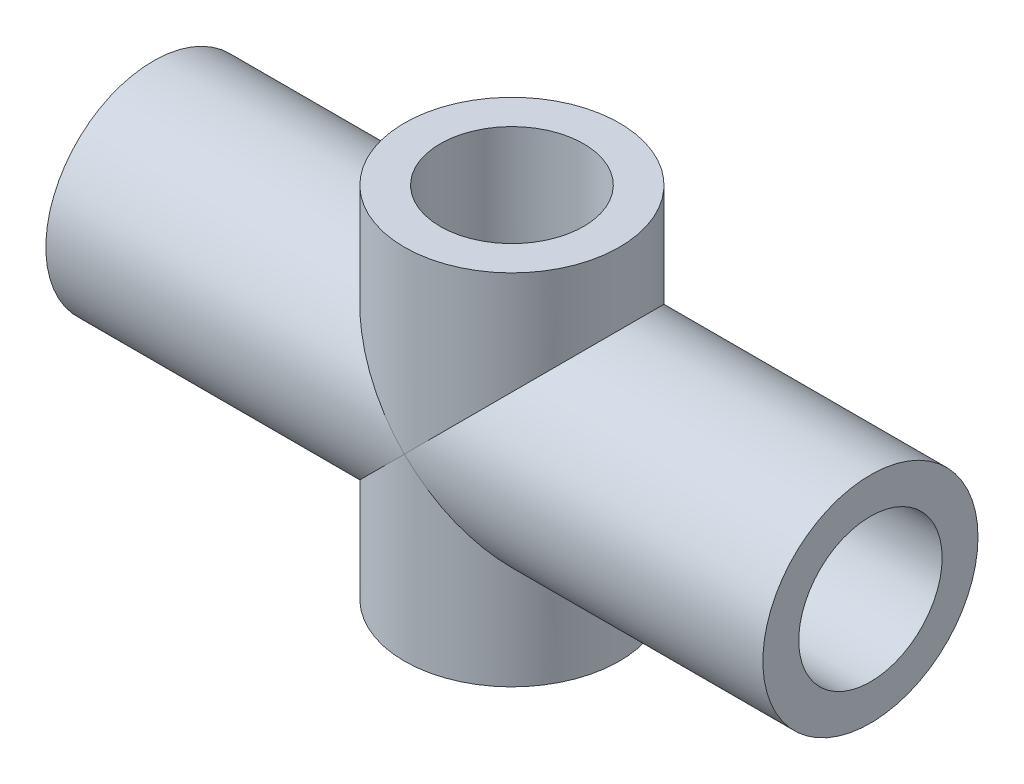
ISO-10303-21;
HEADER;
FILE_DESCRIPTION(('STEP AP214'),'2;1');
FILE_NAME('part.step','',(''),(''),'','','');
FILE_SCHEMA(('AUTOMOTIVE_DESIGN { 1 0 10303 214 1 1 1 1 }'));
ENDSEC;
DATA;
#1=APPLICATION_CONTEXT('core data for automotive mechanical design processes');
#2=APPLICATION_PROTOCOL_DEFINITION('international standard','automotive_design',2000,#1);
#3=PRODUCT_CONTEXT('',#1,'mechanical');
#4=PRODUCT('Part','Part','',(#3));
#5=PRODUCT_RELATED_PRODUCT_CATEGORY('part','',(#4));
#6=PRODUCT_DEFINITION_FORMATION('','',#4);
#7=PRODUCT_DEFINITION_CONTEXT('part definition',#1,'design');
#8=PRODUCT_DEFINITION('design','',#6,#7);
#9=PRODUCT_DEFINITION_SHAPE('','',#8);
#10=(LENGTH_UNIT() NAMED_UNIT(*) SI_UNIT(.MILLI.,.METRE.));
#11=(NAMED_UNIT(*) PLANE_ANGLE_UNIT() SI_UNIT($,.RADIAN.));
#12=(NAMED_UNIT(*) SI_UNIT($,.STERADIAN.) SOLID_ANGLE_UNIT());
#13=UNCERTAINTY_MEASURE_WITH_UNIT(LENGTH_MEASURE(1.E-05),#10,'distance_accuracy_value','');
#14=(GEOMETRIC_REPRESENTATION_CONTEXT(3) GLOBAL_UNCERTAINTY_ASSIGNED_CONTEXT((#13)) GLOBAL_UNIT_ASSIGNED_CONTEXT((#10,
#11,#12)) REPRESENTATION_CONTEXT('',''));
#15=CARTESIAN_POINT('',(0.,0.,0.));
#16=DIRECTION('',(0.,0.,1.));
#17=DIRECTION('',(1.,0.,0.));
#18=AXIS2_PLACEMENT_3D('',#15,#16,#17);
#19=CARTESIAN_POINT('',(0.,-5.,0.));
#20=DIRECTION('',(0.,1.,0.));
#21=DIRECTION('',(0.,0.,1.));
#22=AXIS2_PLACEMENT_3D('',#19,#20,#21);
#23=CYLINDRICAL_SURFACE('',#22,3.);
#24=CARTESIAN_POINT('',(0.,0.,0.));
#25=DIRECTION('',(0.707106781186547,0.707106781186547,0.));
#26=DIRECTION('',(-0.707106781186547,0.707106781186547,0.));
#27=AXIS2_PLACEMENT_3D('',#24,#25,#26);
#28=ELLIPSE('',#27,4.24264068711929,3.);
#29=CARTESIAN_POINT('',(0.,0.,3.));
#30=VERTEX_POINT('',#29);
#31=CARTESIAN_POINT('',(0.,0.,-3.));
#32=VERTEX_POINT('',#31);
#33=EDGE_CURVE('E46',#30,#32,#28,.T.);
#34=ORIENTED_EDGE('',*,*,#33,.F.);
#35=CARTESIAN_POINT('',(0.,0.,0.));
#36=DIRECTION('',(-0.707106781186547,0.707106781186547,0.));
#37=DIRECTION('',(0.707106781186547,0.707106781186547,0.));
#38=AXIS2_PLACEMENT_3D('',#35,#36,#37);
#39=ELLIPSE('',#38,4.24264068711929,3.);
#40=EDGE_CURVE('E59',#32,#30,#39,.T.);
#41=ORIENTED_EDGE('',*,*,#40,.F.);
#42=EDGE_LOOP('',(#34,#41));
#43=FACE_BOUND('',#42,.T.);
#44=CARTESIAN_POINT('',(0.,-5.,0.));
#45=DIRECTION('',(0.,1.,0.));
#46=DIRECTION('',(0.,0.,1.));
#47=AXIS2_PLACEMENT_3D('',#44,#45,#46);
#48=CIRCLE('',#47,3.);
#49=CARTESIAN_POINT('',(0.,-5.,3.));
#50=VERTEX_POINT('',#49);
#51=EDGE_CURVE('E112',#50,#50,#48,.T.);
#52=ORIENTED_EDGE('',*,*,#51,.T.);
#53=EDGE_LOOP('',(#52));
#54=FACE_BOUND('',#53,.T.);
#55=ADVANCED_FACE('F39',(#43,#54),#23,.T.);
#56=CARTESIAN_POINT('',(0.,-5.,0.));
#57=DIRECTION('',(0.,1.,0.));
#58=DIRECTION('',(0.,0.,1.));
#59=AXIS2_PLACEMENT_3D('',#56,#57,#58);
#60=PLANE('',#59);
#61=CARTESIAN_POINT('',(0.,-5.,0.));
#62=DIRECTION('',(0.,1.,0.));
#63=DIRECTION('',(0.,0.,1.));
#64=AXIS2_PLACEMENT_3D('',#61,#62,#63);
#65=CIRCLE('',#64,2.);
#66=CARTESIAN_POINT('',(0.,-5.,2.));
#67=VERTEX_POINT('',#66);
#68=EDGE_CURVE('E83',#67,#67,#65,.T.);
#69=ORIENTED_EDGE('',*,*,#68,.T.);
#70=EDGE_LOOP('',(#69));
#71=FACE_BOUND('',#70,.T.);
#72=ORIENTED_EDGE('',*,*,#51,.F.);
#73=EDGE_LOOP('',(#72));
#74=FACE_BOUND('',#73,.T.);
#75=ADVANCED_FACE('F138',(#71,#74),#60,.F.);
#76=CARTESIAN_POINT('',(10.,0.,0.));
#77=DIRECTION('',(1.,0.,0.));
#78=DIRECTION('',(0.,0.,-1.));
#79=AXIS2_PLACEMENT_3D('',#76,#77,#78);
#80=PLANE('',#79);
#81=CARTESIAN_POINT('',(10.,0.,0.));
#82=DIRECTION('',(1.,0.,0.));
#83=DIRECTION('',(0.,0.,-1.));
#84=AXIS2_PLACEMENT_3D('',#81,#82,#83);
#85=CIRCLE('',#84,2.);
#86=CARTESIAN_POINT('',(10.,0.,-2.));
#87=VERTEX_POINT('',#86);
#88=EDGE_CURVE('E99',#87,#87,#85,.T.);
#89=ORIENTED_EDGE('',*,*,#88,.F.);
#90=EDGE_LOOP('',(#89));
#91=FACE_BOUND('',#90,.T.);
#92=CARTESIAN_POINT('',(10.,0.,0.));
#93=DIRECTION('',(1.,0.,0.));
#94=DIRECTION('',(0.,0.,-1.));
#95=AXIS2_PLACEMENT_3D('',#92,#93,#94);
#96=CIRCLE('',#95,3.);
#97=CARTESIAN_POINT('',(10.,0.,-3.));
#98=VERTEX_POINT('',#97);
#99=EDGE_CURVE('E90',#98,#98,#96,.T.);
#100=ORIENTED_EDGE('',*,*,#99,.T.);
#101=EDGE_LOOP('',(#100));
#102=FACE_BOUND('',#101,.T.);
#103=ADVANCED_FACE('F133',(#91,#102),#80,.T.);
#104=CARTESIAN_POINT('',(-10.,0.,0.));
#105=DIRECTION('',(1.,0.,0.));
#106=DIRECTION('',(0.,0.,-1.));
#107=AXIS2_PLACEMENT_3D('',#104,#105,#106);
#108=CYLINDRICAL_SURFACE('',#107,3.);
#109=ORIENTED_EDGE('',*,*,#99,.F.);
#110=EDGE_LOOP('',(#109));
#111=FACE_BOUND('',#110,.T.);
#112=CARTESIAN_POINT('',(0.,0.,0.));
#113=DIRECTION('',(-0.707106781186547,0.707106781186547,0.));
#114=DIRECTION('',(0.707106781186547,0.707106781186547,0.));
#115=AXIS2_PLACEMENT_3D('',#112,#113,#114);
#116=ELLIPSE('',#115,4.24264068711929,3.);
#117=EDGE_CURVE('E52',#32,#30,#116,.F.);
#118=ORIENTED_EDGE('',*,*,#117,.T.);
#119=ORIENTED_EDGE('',*,*,#33,.T.);
#120=EDGE_LOOP('',(#118,#119));
#121=FACE_BOUND('',#120,.T.);
#122=ADVANCED_FACE('F116',(#111,#121),#108,.T.);
#123=CARTESIAN_POINT('',(0.,5.,0.));
#124=DIRECTION('',(0.,1.,0.));
#125=DIRECTION('',(0.,0.,1.));
#126=AXIS2_PLACEMENT_3D('',#123,#124,#125);
#127=PLANE('',#126);
#128=CARTESIAN_POINT('',(0.,5.,0.));
#129=DIRECTION('',(0.,1.,0.));
#130=DIRECTION('',(0.,0.,1.));
#131=AXIS2_PLACEMENT_3D('',#128,#129,#130);
#132=CIRCLE('',#131,2.);
#133=CARTESIAN_POINT('',(0.,5.,2.));
#134=VERTEX_POINT('',#133);
#135=EDGE_CURVE('E98',#134,#134,#132,.T.);
#136=ORIENTED_EDGE('',*,*,#135,.F.);
#137=EDGE_LOOP('',(#136));
#138=FACE_BOUND('',#137,.T.);
#139=CARTESIAN_POINT('',(0.,5.,0.));
#140=DIRECTION('',(0.,1.,0.));
#141=DIRECTION('',(0.,0.,1.));
#142=AXIS2_PLACEMENT_3D('',#139,#140,#141);
#143=CIRCLE('',#142,3.);
#144=CARTESIAN_POINT('',(0.,5.,3.));
#145=VERTEX_POINT('',#144);
#146=EDGE_CURVE('E109',#145,#145,#143,.T.);
#147=ORIENTED_EDGE('',*,*,#146,.T.);
#148=EDGE_LOOP('',(#147));
#149=FACE_BOUND('',#148,.T.);
#150=ADVANCED_FACE('F124',(#138,#149),#127,.T.);
#151=CARTESIAN_POINT('',(0.,0.,0.));
#152=DIRECTION('',(0.707106781186547,0.707106781186547,0.));
#153=DIRECTION('',(-0.707106781186547,0.707106781186547,0.));
#154=AXIS2_PLACEMENT_3D('',#151,#152,#153);
#155=ELLIPSE('',#154,4.24264068711929,3.);
#156=EDGE_CURVE('E11',#30,#32,#155,.F.);
#157=ORIENTED_EDGE('',*,*,#156,.F.);
#158=ORIENTED_EDGE('',*,*,#117,.F.);
#159=EDGE_LOOP('',(#157,#158));
#160=FACE_BOUND('',#159,.T.);
#161=ORIENTED_EDGE('',*,*,#146,.F.);
#162=EDGE_LOOP('',(#161));
#163=FACE_BOUND('',#162,.T.);
#164=ADVANCED_FACE('F121',(#160,#163),#23,.T.);
#165=ORIENTED_EDGE('',*,*,#40,.T.);
#166=ORIENTED_EDGE('',*,*,#156,.T.);
#167=EDGE_LOOP('',(#165,#166));
#168=FACE_BOUND('',#167,.T.);
#169=CARTESIAN_POINT('',(-10.,0.,0.));
#170=DIRECTION('',(1.,0.,0.));
#171=DIRECTION('',(0.,0.,-1.));
#172=AXIS2_PLACEMENT_3D('',#169,#170,#171);
#173=CIRCLE('',#172,3.);
#174=CARTESIAN_POINT('',(-10.,0.,-3.));
#175=VERTEX_POINT('',#174);
#176=EDGE_CURVE('E93',#175,#175,#173,.T.);
#177=ORIENTED_EDGE('',*,*,#176,.T.);
#178=EDGE_LOOP('',(#177));
#179=FACE_BOUND('',#178,.T.);
#180=ADVANCED_FACE('F118',(#168,#179),#108,.T.);
#181=CARTESIAN_POINT('',(-10.,0.,0.));
#182=DIRECTION('',(1.,0.,0.));
#183=DIRECTION('',(0.,0.,-1.));
#184=AXIS2_PLACEMENT_3D('',#181,#182,#183);
#185=PLANE('',#184);
#186=CARTESIAN_POINT('',(-10.,0.,0.));
#187=DIRECTION('',(1.,0.,0.));
#188=DIRECTION('',(0.,0.,-1.));
#189=AXIS2_PLACEMENT_3D('',#186,#187,#188);
#190=CIRCLE('',#189,2.);
#191=CARTESIAN_POINT('',(-10.,0.,-2.));
#192=VERTEX_POINT('',#191);
#193=EDGE_CURVE('E102',#192,#192,#190,.T.);
#194=ORIENTED_EDGE('',*,*,#193,.T.);
#195=EDGE_LOOP('',(#194));
#196=FACE_BOUND('',#195,.T.);
#197=ORIENTED_EDGE('',*,*,#176,.F.);
#198=EDGE_LOOP('',(#197));
#199=FACE_BOUND('',#198,.T.);
#200=ADVANCED_FACE('F153',(#196,#199),#185,.F.);
#201=CARTESIAN_POINT('',(0.,-5.,0.));
#202=DIRECTION('',(0.,1.,0.));
#203=DIRECTION('',(0.,0.,1.));
#204=AXIS2_PLACEMENT_3D('',#201,#202,#203);
#205=CYLINDRICAL_SURFACE('',#204,2.);
#206=CARTESIAN_POINT('',(0.,0.,0.));
#207=DIRECTION('',(0.707106781186547,0.707106781186547,0.));
#208=DIRECTION('',(-0.707106781186547,0.707106781186547,0.));
#209=AXIS2_PLACEMENT_3D('',#206,#207,#208);
#210=ELLIPSE('',#209,2.82842712474619,2.);
#211=CARTESIAN_POINT('',(0.,0.,2.));
#212=VERTEX_POINT('',#211);
#213=CARTESIAN_POINT('',(0.,0.,-2.));
#214=VERTEX_POINT('',#213);
#215=EDGE_CURVE('E77',#212,#214,#210,.T.);
#216=ORIENTED_EDGE('',*,*,#215,.T.);
#217=CARTESIAN_POINT('',(0.,0.,0.));
#218=DIRECTION('',(-0.707106781186547,0.707106781186547,0.));
#219=DIRECTION('',(0.707106781186547,0.707106781186547,0.));
#220=AXIS2_PLACEMENT_3D('',#217,#218,#219);
#221=ELLIPSE('',#220,2.82842712474619,2.);
#222=EDGE_CURVE('E68',#214,#212,#221,.T.);
#223=ORIENTED_EDGE('',*,*,#222,.T.);
#224=EDGE_LOOP('',(#216,#223));
#225=FACE_BOUND('',#224,.T.);
#226=ORIENTED_EDGE('',*,*,#68,.F.);
#227=EDGE_LOOP('',(#226));
#228=FACE_BOUND('',#227,.T.);
#229=ADVANCED_FACE('F85',(#225,#228),#205,.F.);
#230=CARTESIAN_POINT('',(-10.,0.,0.));
#231=DIRECTION('',(1.,0.,0.));
#232=DIRECTION('',(0.,0.,-1.));
#233=AXIS2_PLACEMENT_3D('',#230,#231,#232);
#234=CYLINDRICAL_SURFACE('',#233,2.);
#235=ORIENTED_EDGE('',*,*,#88,.T.);
#236=EDGE_LOOP('',(#235));
#237=FACE_BOUND('',#236,.T.);
#238=CARTESIAN_POINT('',(0.,0.,0.));
#239=DIRECTION('',(-0.707106781186547,0.707106781186547,0.));
#240=DIRECTION('',(0.707106781186547,0.707106781186547,0.));
#241=AXIS2_PLACEMENT_3D('',#238,#239,#240);
#242=ELLIPSE('',#241,2.82842712474619,2.);
#243=EDGE_CURVE('E78',#214,#212,#242,.F.);
#244=ORIENTED_EDGE('',*,*,#243,.F.);
#245=ORIENTED_EDGE('',*,*,#215,.F.);
#246=EDGE_LOOP('',(#244,#245));
#247=FACE_BOUND('',#246,.T.);
#248=ADVANCED_FACE('F81',(#237,#247),#234,.F.);
#249=CARTESIAN_POINT('',(0.,0.,0.));
#250=DIRECTION('',(0.707106781186547,0.707106781186547,0.));
#251=DIRECTION('',(-0.707106781186547,0.707106781186547,0.));
#252=AXIS2_PLACEMENT_3D('',#249,#250,#251);
#253=ELLIPSE('',#252,2.82842712474619,2.);
#254=EDGE_CURVE('E73',#212,#214,#253,.F.);
#255=ORIENTED_EDGE('',*,*,#254,.T.);
#256=ORIENTED_EDGE('',*,*,#243,.T.);
#257=EDGE_LOOP('',(#255,#256));
#258=FACE_BOUND('',#257,.T.);
#259=ORIENTED_EDGE('',*,*,#135,.T.);
#260=EDGE_LOOP('',(#259));
#261=FACE_BOUND('',#260,.T.);
#262=ADVANCED_FACE('F88',(#258,#261),#205,.F.);
#263=ORIENTED_EDGE('',*,*,#222,.F.);
#264=ORIENTED_EDGE('',*,*,#254,.F.);
#265=EDGE_LOOP('',(#263,#264));
#266=FACE_BOUND('',#265,.T.);
#267=ORIENTED_EDGE('',*,*,#193,.F.);
#268=EDGE_LOOP('',(#267));
#269=FACE_BOUND('',#268,.T.);
#270=ADVANCED_FACE('F70',(#266,#269),#234,.F.);
#271=CLOSED_SHELL('',(#55,#75,#103,#122,#150,#164,#180,#200,#229,#248,#262,#270));
#272=MANIFOLD_SOLID_BREP('B2',#271);
#273=ADVANCED_BREP_SHAPE_REPRESENTATION('',(#18,#272),#14);
#274=SHAPE_DEFINITION_REPRESENTATION(#9,#273);
ENDSEC;
END-ISO-10303-21;
